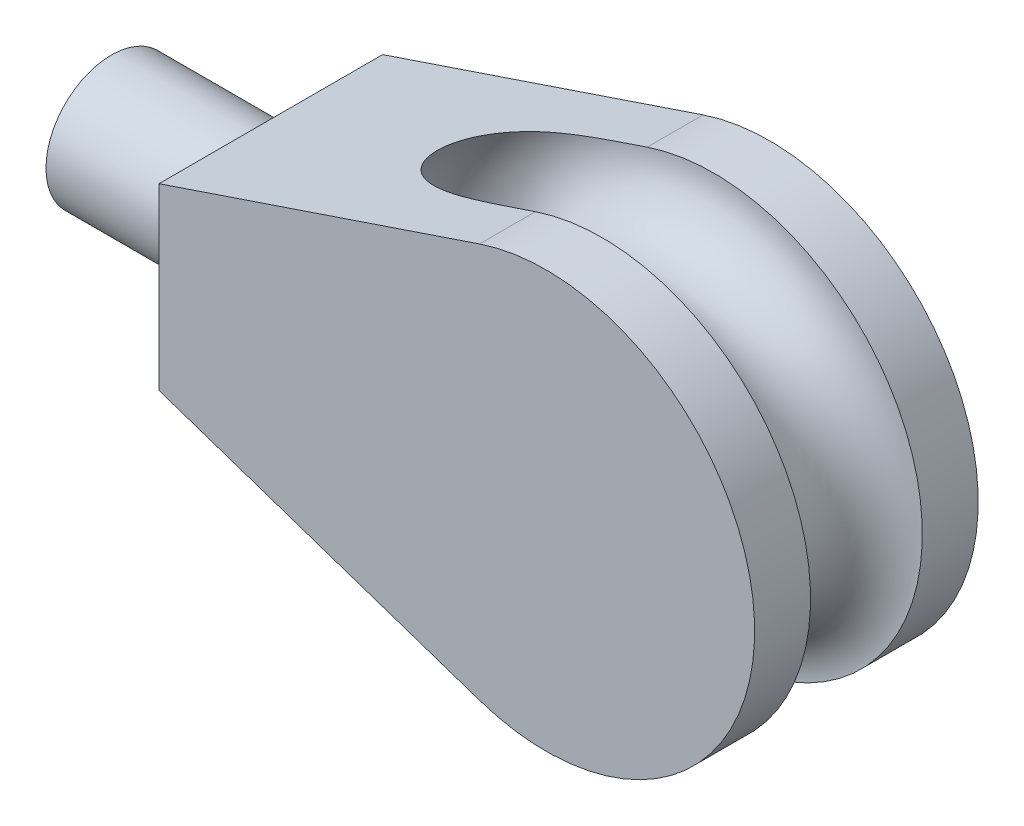
ISO-10303-21;
HEADER;
FILE_DESCRIPTION(('STEP AP214'),'2;1');
FILE_NAME('part.step','',(''),(''),'','','');
FILE_SCHEMA(('AUTOMOTIVE_DESIGN { 1 0 10303 214 1 1 1 1 }'));
ENDSEC;
DATA;
#1=APPLICATION_CONTEXT('core data for automotive mechanical design processes');
#2=APPLICATION_PROTOCOL_DEFINITION('international standard','automotive_design',2000,#1);
#3=PRODUCT_CONTEXT('',#1,'mechanical');
#4=PRODUCT('Part','Part','',(#3));
#5=PRODUCT_RELATED_PRODUCT_CATEGORY('part','',(#4));
#6=PRODUCT_DEFINITION_FORMATION('','',#4);
#7=PRODUCT_DEFINITION_CONTEXT('part definition',#1,'design');
#8=PRODUCT_DEFINITION('design','',#6,#7);
#9=PRODUCT_DEFINITION_SHAPE('','',#8);
#10=(LENGTH_UNIT() NAMED_UNIT(*) SI_UNIT(.MILLI.,.METRE.));
#11=(NAMED_UNIT(*) PLANE_ANGLE_UNIT() SI_UNIT($,.RADIAN.));
#12=(NAMED_UNIT(*) SI_UNIT($,.STERADIAN.) SOLID_ANGLE_UNIT());
#13=UNCERTAINTY_MEASURE_WITH_UNIT(LENGTH_MEASURE(1.E-05),#10,'distance_accuracy_value','');
#14=(GEOMETRIC_REPRESENTATION_CONTEXT(3) GLOBAL_UNCERTAINTY_ASSIGNED_CONTEXT((#13)) GLOBAL_UNIT_ASSIGNED_CONTEXT((#10,
#11,#12)) REPRESENTATION_CONTEXT('',''));
#15=CARTESIAN_POINT('',(0.,0.,0.));
#16=DIRECTION('',(0.,0.,1.));
#17=DIRECTION('',(1.,0.,0.));
#18=AXIS2_PLACEMENT_3D('',#15,#16,#17);
#19=CARTESIAN_POINT('',(-27.441594764438,6.35,7.9248));
#20=DIRECTION('',(0.319422438213122,-0.94761242391918,0.));
#21=DIRECTION('',(0.947612423919181,0.319422438213122,0.));
#22=AXIS2_PLACEMENT_3D('',#19,#20,#21);
#23=PLANE('',#22);
#24=CARTESIAN_POINT('',(-4.72175801961694,14.0084323565747,-3.9624));
#25=CARTESIAN_POINT('',(-4.87375292125447,13.9571977158592,-3.96238917819467));
#26=CARTESIAN_POINT('',(-5.02574780493794,13.9059630811957,-3.96239972989753));
#27=CARTESIAN_POINT('',(-5.32973779687316,13.8034937361709,-3.9623848262693));
#28=CARTESIAN_POINT('',(-5.4817329051249,13.7522590258096,-3.96235937088398));
#29=CARTESIAN_POINT('',(-5.78575466978362,13.6497789707936,-3.9621936814085));
#30=CARTESIAN_POINT('',(-5.93778132619623,13.5985336261369,-3.96205342351644));
#31=CARTESIAN_POINT('',(-6.24183410360383,13.4960431173028,-3.96149899201322));
#32=CARTESIAN_POINT('',(-6.39386022459869,13.4447979531254,-3.9610848183384));
#33=CARTESIAN_POINT('',(-6.85433481346953,13.2895805750079,-3.95911611340927));
#34=CARTESIAN_POINT('',(-7.16278204437302,13.1856087780281,-3.95682671973771));
#35=CARTESIAN_POINT('',(-7.77959982918194,12.9776910304515,-3.94787786773061));
#36=CARTESIAN_POINT('',(-8.08797038769579,12.8737450783013,-3.94121885404123));
#37=CARTESIAN_POINT('',(-8.71988771733575,12.6607375563569,-3.91969862529159));
#38=CARTESIAN_POINT('',(-9.04342393457329,12.5516795440813,-3.90444470085073));
#39=CARTESIAN_POINT('',(-9.68989459129765,12.3337663675633,-3.86068301344577));
#40=CARTESIAN_POINT('',(-10.0128287360294,12.2249113026774,-3.83216991636855));
#41=CARTESIAN_POINT('',(-10.6546572606567,12.0085629021327,-3.75631728653127));
#42=CARTESIAN_POINT('',(-10.9735642514009,11.9010653155926,-3.7091017542555));
#43=CARTESIAN_POINT('',(-11.6069235464141,11.6875717340697,-3.5890137292223));
#44=CARTESIAN_POINT('',(-11.9213807301883,11.581574094297,-3.51617204467111));
#45=CARTESIAN_POINT('',(-12.3571778504603,11.4346750296479,-3.38995389300559));
#46=CARTESIAN_POINT('',(-12.4822277110375,11.3925230586991,-3.35073480048685));
#47=CARTESIAN_POINT('',(-12.7304964966942,11.3088362909395,-3.26603879937078));
#48=CARTESIAN_POINT('',(-12.8537144778912,11.2673018122938,-3.2205587807247));
#49=CARTESIAN_POINT('',(-13.0974630737717,11.1851387160301,-3.12277136846088));
#50=CARTESIAN_POINT('',(-13.2179980125137,11.1445086408527,-3.07047605745588));
#51=CARTESIAN_POINT('',(-13.4558504863838,11.0643330171263,-2.958295743983));
#52=CARTESIAN_POINT('',(-13.5731684038016,11.0247873397145,-2.89841164811279));
#53=CARTESIAN_POINT('',(-13.8053521564008,10.9465225359861,-2.76936449751491));
#54=CARTESIAN_POINT('',(-13.9201583628721,10.9078235093931,-2.7000802541223));
#55=CARTESIAN_POINT('',(-14.1442443397287,10.8322883145284,-2.55220447949276));
#56=CARTESIAN_POINT('',(-14.253521856054,10.7954529060582,-2.47360919507086));
#57=CARTESIAN_POINT('',(-14.5701788592593,10.6887137482676,-2.22308390149108));
#58=CARTESIAN_POINT('',(-14.7674551575663,10.622215594997,-2.0358476275286));
#59=CARTESIAN_POINT('',(-15.04380177349,10.5290643153998,-1.70518791285539));
#60=CARTESIAN_POINT('',(-15.1379931516991,10.4973141621443,-1.57572698413031));
#61=CARTESIAN_POINT('',(-15.306154707292,10.4406300445184,-1.3026150863655));
#62=CARTESIAN_POINT('',(-15.3801339922191,10.4156930101653,-1.15897054829757));
#63=CARTESIAN_POINT('',(-15.4724952408247,10.384559759396,-0.934242571539767));
#64=CARTESIAN_POINT('',(-15.5002764283734,10.3751952402748,-0.857363837955497));
#65=CARTESIAN_POINT('',(-15.5488762809126,10.3588131382646,-0.7012083111911));
#66=CARTESIAN_POINT('',(-15.5696985528676,10.3517943395351,-0.621932783633136));
#67=CARTESIAN_POINT('',(-15.6039043201023,10.3402642146705,-0.461648100792318));
#68=CARTESIAN_POINT('',(-15.6172916760767,10.3357515871673,-0.380639867981749));
#69=CARTESIAN_POINT('',(-15.6363339408573,10.3293327955898,-0.217645525964102));
#70=CARTESIAN_POINT('',(-15.6419899056447,10.3274262755641,-0.135659551843766));
#71=CARTESIAN_POINT('',(-15.6466609182038,10.3258517645268,0.0898129764185861));
#72=CARTESIAN_POINT('',(-15.6375805859554,10.3289125748258,0.233578175398194));
#73=CARTESIAN_POINT('',(-15.5959498311145,10.3429455242471,0.517148136399786));
#74=CARTESIAN_POINT('',(-15.5633988020472,10.3539178678009,0.656952795985751));
#75=CARTESIAN_POINT('',(-15.4782731847583,10.3826121224798,0.925464285145831));
#76=CARTESIAN_POINT('',(-15.4262412624917,10.4001511110534,1.05436515897316));
#77=CARTESIAN_POINT('',(-15.3050396881039,10.4410058966482,1.30277617976003));
#78=CARTESIAN_POINT('',(-15.2358629045748,10.4643240975338,1.42228239169345));
#79=CARTESIAN_POINT('',(-15.0461523222668,10.5282719893364,1.70659234222675));
#80=CARTESIAN_POINT('',(-14.9170352748193,10.5717949329677,1.86501980001182));
#81=CARTESIAN_POINT('',(-14.6364695857077,10.6663683832865,2.15810602678022));
#82=CARTESIAN_POINT('',(-14.4849702444268,10.7174359798673,2.29270926718208));
#83=CARTESIAN_POINT('',(-14.203513362175,10.8123098347382,2.51100585959219));
#84=CARTESIAN_POINT('',(-14.0766731226746,10.8550653089616,2.59927466387219));
#85=CARTESIAN_POINT('',(-13.8161131013922,10.9428952225403,2.76378988250034));
#86=CARTESIAN_POINT('',(-13.6823893221164,10.9879710093759,2.8400292040527));
#87=CARTESIAN_POINT('',(-13.4097475174367,11.0798734663419,2.9816646847918));
#88=CARTESIAN_POINT('',(-13.2708238722312,11.1267020308023,3.04704867151826));
#89=CARTESIAN_POINT('',(-12.9892653298239,11.2216101534116,3.16801716458123));
#90=CARTESIAN_POINT('',(-12.8466312202841,11.2696894460544,3.22360373155704));
#91=CARTESIAN_POINT('',(-12.5264340373501,11.3776219322694,3.33753848647521));
#92=CARTESIAN_POINT('',(-12.3481853544484,11.4377062319931,3.39373019666638));
#93=CARTESIAN_POINT('',(-11.9888341513413,11.5588368066605,3.49496099924588));
#94=CARTESIAN_POINT('',(-11.8077304826174,11.6198834687483,3.53999547482943));
#95=CARTESIAN_POINT('',(-11.4433569063811,11.7427069915346,3.62059861667516));
#96=CARTESIAN_POINT('',(-11.2600839427954,11.8044848823784,3.6561516956989));
#97=CARTESIAN_POINT('',(-10.8923381654409,11.9284451111387,3.71917469293869));
#98=CARTESIAN_POINT('',(-10.7078655055087,11.9906273971998,3.74664562742104));
#99=CARTESIAN_POINT('',(-10.3366547925256,12.1157555910045,3.79503510718763));
#100=CARTESIAN_POINT('',(-10.149910462866,12.1787036144756,3.81589907090181));
#101=CARTESIAN_POINT('',(-9.77592631071417,12.3047666827913,3.85199582633532));
#102=CARTESIAN_POINT('',(-9.58868644206782,12.3678817431937,3.8672280734958));
#103=CARTESIAN_POINT('',(-9.2140905939859,12.4941510027756,3.89314575412079));
#104=CARTESIAN_POINT('',(-9.02673484601473,12.5573051239327,3.90383501517843));
#105=CARTESIAN_POINT('',(-8.65186914415107,12.6836653461811,3.92166151611251));
#106=CARTESIAN_POINT('',(-8.46435918412974,12.7468714493383,3.92879860722922));
#107=CARTESIAN_POINT('',(-7.97802606381771,12.9108052551356,3.94383798648918));
#108=CARTESIAN_POINT('',(-7.67914827409666,13.0115513723357,3.94968314824669));
#109=CARTESIAN_POINT('',(-7.08132592750043,13.2130661126958,3.95753301352023));
#110=CARTESIAN_POINT('',(-6.78238136690435,13.31383473711,3.95953726821307));
#111=CARTESIAN_POINT('',(-6.3366141547673,13.4640945333961,3.96125550703739));
#112=CARTESIAN_POINT('',(-6.18979302747341,13.5135851914728,3.96161594287448));
#113=CARTESIAN_POINT('',(-5.89615052829348,13.6125665900736,3.96209843227997));
#114=CARTESIAN_POINT('',(-5.74932915640773,13.6620573305977,3.96222048602849));
#115=CARTESIAN_POINT('',(-5.45571611101741,13.7610288008765,3.9623646619029));
#116=CARTESIAN_POINT('',(-5.3089244375132,13.8105095306311,3.96238680423868));
#117=CARTESIAN_POINT('',(-5.01534118340458,13.9094709588257,3.96239976093781));
#118=CARTESIAN_POINT('',(-4.86854960280018,13.9589516572655,3.96239057532172));
#119=CARTESIAN_POINT('',(-4.72175801961694,14.0084323565747,3.9624));
#120=B_SPLINE_CURVE_WITH_KNOTS('',3,(#24,#25,#26,#27,#28,#29,#30,#31,#32,#33,#34,#35,#36,#37,
#38,#39,#40,#41,#42,#43,#44,#45,#46,#47,#48,#49,#50,#51,#52,#53,#54,#55,#56,#57,#58,#59,#60,#61,
#62,#63,#64,#65,#66,#67,#68,#69,#70,#71,#72,#73,#74,#75,#76,#77,#78,#79,#80,#81,#82,#83,#84,#85,
#86,#87,#88,#89,#90,#91,#92,#93,#94,#95,#96,#97,#98,#99,#100,#101,#102,#103,#104,#105,#106,#107,
#108,#109,#110,#111,#112,#113,#114,#115,#116,#117,#118,#119),.UNSPECIFIED.,.F.,.F.,(4,2,2,2,2,2,
2,2,2,2,2,2,2,2,2,2,2,2,2,2,2,2,2,2,2,2,2,2,2,2,2,2,2,2,2,2,2,2,2,2,2,2,2,2,2,2,2,4),(0.,
0.481193212926235,0.96238715066043,1.44368087919563,1.92497471958098,2.90148405432016,
3.87789403630306,4.90302694671164,5.92857262132071,6.94742960029572,7.96506585404123,
8.37794487966876,8.79102974364672,9.20339197967427,9.61570499901703,10.033954737665,
10.4523736458242,11.2854558228466,11.7735710049318,12.2614658788314,12.5080002162783,
12.7544065704565,13.0006848544195,13.2469294974466,13.6767684613279,14.1066185325009,
14.5252915334791,14.9441389746924,15.5675118125364,16.1923189808555,16.6726758225986,
17.1533148413126,17.6344892292539,18.1155622932607,18.7040903835952,19.2928615985178,
19.882594857395,20.4722539302149,21.066664365639,21.6611322625587,22.2550983059142,
22.8490892216124,23.795404476015,24.7418303038642,25.2066452996287,25.671459944159,
26.1361805626305,26.6009008761329),.UNSPECIFIED.);
#121=CARTESIAN_POINT('',(-4.72195801961694,14.0083649403125,-3.9624));
#122=VERTEX_POINT('',#121);
#123=CARTESIAN_POINT('',(-4.72195801961694,14.0083649403125,3.9624));
#124=VERTEX_POINT('',#123);
#125=EDGE_CURVE('E96',#122,#124,#120,.T.);
#126=ORIENTED_EDGE('',*,*,#125,.F.);
#127=DIRECTION('',(0.,0.,-1.));
#128=VECTOR('',#127,1.);
#129=CARTESIAN_POINT('',(-4.72195801961694,14.0083649403125,7.9248));
#130=LINE('',#129,#128);
#131=CARTESIAN_POINT('',(-4.72195801961694,14.0083649403125,-7.9248));
#132=VERTEX_POINT('',#131);
#133=EDGE_CURVE('E80',#122,#132,#130,.T.);
#134=ORIENTED_EDGE('',*,*,#133,.T.);
#135=DIRECTION('',(-0.94761242391918,-0.319422438213122,0.));
#136=VECTOR('',#135,1.);
#137=CARTESIAN_POINT('',(-27.441594764438,6.35,-7.9248));
#138=LINE('',#137,#136);
#139=CARTESIAN_POINT('',(-27.441594764438,6.35,-7.9248));
#140=VERTEX_POINT('',#139);
#141=EDGE_CURVE('E135',#132,#140,#138,.T.);
#142=ORIENTED_EDGE('',*,*,#141,.T.);
#143=DIRECTION('',(0.,0.,-1.));
#144=VECTOR('',#143,1.);
#145=CARTESIAN_POINT('',(-27.441594764438,6.35,7.9248));
#146=LINE('',#145,#144);
#147=CARTESIAN_POINT('',(-27.441594764438,6.35,7.9248));
#148=VERTEX_POINT('',#147);
#149=EDGE_CURVE('E123',#148,#140,#146,.T.);
#150=ORIENTED_EDGE('',*,*,#149,.F.);
#151=DIRECTION('',(-0.94761242391918,-0.319422438213122,0.));
#152=VECTOR('',#151,1.);
#153=CARTESIAN_POINT('',(-27.441594764438,6.35,7.9248));
#154=LINE('',#153,#152);
#155=CARTESIAN_POINT('',(-4.72195801961694,14.0083649403125,7.9248));
#156=VERTEX_POINT('',#155);
#157=EDGE_CURVE('E131',#156,#148,#154,.T.);
#158=ORIENTED_EDGE('',*,*,#157,.F.);
#159=EDGE_CURVE('E103',#156,#124,#130,.T.);
#160=ORIENTED_EDGE('',*,*,#159,.T.);
#161=EDGE_LOOP('',(#126,#134,#142,#150,#158,#160));
#162=FACE_BOUND('',#161,.T.);
#163=ADVANCED_FACE('F35',(#162),#23,.F.);
#164=CARTESIAN_POINT('',(-27.441594764438,-6.35,7.9248));
#165=DIRECTION('',(0.319422438213122,0.94761242391918,0.));
#166=DIRECTION('',(-0.947612423919181,0.319422438213122,0.));
#167=AXIS2_PLACEMENT_3D('',#164,#165,#166);
#168=PLANE('',#167);
#169=CARTESIAN_POINT('',(-4.72175801961694,-14.0084323565747,3.9624));
#170=CARTESIAN_POINT('',(-4.87375292125446,-13.9571977158592,3.96238917819467));
#171=CARTESIAN_POINT('',(-5.02574780493793,-13.9059630811957,3.96239972989753));
#172=CARTESIAN_POINT('',(-5.32973779687315,-13.8034937361709,3.9623848262693));
#173=CARTESIAN_POINT('',(-5.4817329051249,-13.7522590258096,3.96235937088398));
#174=CARTESIAN_POINT('',(-5.78575466978362,-13.6497789707936,3.9621936814085));
#175=CARTESIAN_POINT('',(-5.93778132619623,-13.5985336261369,3.96205342351644));
#176=CARTESIAN_POINT('',(-6.24183410360383,-13.4960431173028,3.96149899201322));
#177=CARTESIAN_POINT('',(-6.39386022459869,-13.4447979531254,3.9610848183384));
#178=CARTESIAN_POINT('',(-6.85433481346953,-13.2895805750079,3.95911611340927));
#179=CARTESIAN_POINT('',(-7.16278204437301,-13.1856087780281,3.95682671973771));
#180=CARTESIAN_POINT('',(-7.77959982918193,-12.9776910304515,3.94787786773061));
#181=CARTESIAN_POINT('',(-8.08797038769578,-12.8737450783013,3.94121885404123));
#182=CARTESIAN_POINT('',(-8.71988771733574,-12.6607375563569,3.91969862529159));
#183=CARTESIAN_POINT('',(-9.04342393457328,-12.5516795440813,3.90444470085073));
#184=CARTESIAN_POINT('',(-9.68989459129764,-12.3337663675633,3.86068301344577));
#185=CARTESIAN_POINT('',(-10.0128287360294,-12.2249113026774,3.83216991636855));
#186=CARTESIAN_POINT('',(-10.6546572606567,-12.0085629021327,3.75631728653128));
#187=CARTESIAN_POINT('',(-10.9735642514009,-11.9010653155926,3.7091017542555));
#188=CARTESIAN_POINT('',(-11.6069235464141,-11.6875717340697,3.5890137292223));
#189=CARTESIAN_POINT('',(-11.9213807301883,-11.581574094297,3.51617204467111));
#190=CARTESIAN_POINT('',(-12.3571778504603,-11.4346750296479,3.38995389300559));
#191=CARTESIAN_POINT('',(-12.4822277110375,-11.3925230586991,3.35073480048686));
#192=CARTESIAN_POINT('',(-12.7304964966942,-11.3088362909395,3.26603879937078));
#193=CARTESIAN_POINT('',(-12.8537144778912,-11.2673018122938,3.2205587807247));
#194=CARTESIAN_POINT('',(-13.0974630737717,-11.1851387160301,3.12277136846088));
#195=CARTESIAN_POINT('',(-13.2179980125137,-11.1445086408527,3.07047605745588));
#196=CARTESIAN_POINT('',(-13.4558504863838,-11.0643330171263,2.95829574398301));
#197=CARTESIAN_POINT('',(-13.5731684038016,-11.0247873397145,2.8984116481128));
#198=CARTESIAN_POINT('',(-13.8053521564008,-10.9465225359861,2.76936449751491));
#199=CARTESIAN_POINT('',(-13.9201583628721,-10.9078235093931,2.7000802541223));
#200=CARTESIAN_POINT('',(-14.1442443397287,-10.8322883145284,2.55220447949276));
#201=CARTESIAN_POINT('',(-14.253521856054,-10.7954529060582,2.47360919507086));
#202=CARTESIAN_POINT('',(-14.5701788592593,-10.6887137482676,2.22308390149108));
#203=CARTESIAN_POINT('',(-14.7674551575663,-10.622215594997,2.0358476275286));
#204=CARTESIAN_POINT('',(-15.04380177349,-10.5290643153998,1.70518791285539));
#205=CARTESIAN_POINT('',(-15.1379931516991,-10.4973141621443,1.57572698413031));
#206=CARTESIAN_POINT('',(-15.306154707292,-10.4406300445184,1.30261508636551));
#207=CARTESIAN_POINT('',(-15.3801339922191,-10.4156930101654,1.15897054829758));
#208=CARTESIAN_POINT('',(-15.4724952408247,-10.384559759396,0.934242571539767));
#209=CARTESIAN_POINT('',(-15.5002764283734,-10.3751952402748,0.857363837955497));
#210=CARTESIAN_POINT('',(-15.5488762809126,-10.3588131382646,0.701208311191101));
#211=CARTESIAN_POINT('',(-15.5696985528676,-10.3517943395351,0.621932783633136));
#212=CARTESIAN_POINT('',(-15.6039043201023,-10.3402642146705,0.461648100792319));
#213=CARTESIAN_POINT('',(-15.6172916760767,-10.3357515871673,0.38063986798175));
#214=CARTESIAN_POINT('',(-15.6363339408573,-10.3293327955898,0.217645525964103));
#215=CARTESIAN_POINT('',(-15.6419899056447,-10.3274262755641,0.135659551843767));
#216=CARTESIAN_POINT('',(-15.6466609182038,-10.3258517645268,-0.0898129764185863));
#217=CARTESIAN_POINT('',(-15.6375805859554,-10.3289125748258,-0.233578175398195));
#218=CARTESIAN_POINT('',(-15.5959498311145,-10.3429455242471,-0.517148136399786));
#219=CARTESIAN_POINT('',(-15.5633988020472,-10.3539178678009,-0.656952795985752));
#220=CARTESIAN_POINT('',(-15.4782731847583,-10.3826121224798,-0.925464285145831));
#221=CARTESIAN_POINT('',(-15.4262412624917,-10.4001511110534,-1.05436515897316));
#222=CARTESIAN_POINT('',(-15.3050396881039,-10.4410058966482,-1.30277617976003));
#223=CARTESIAN_POINT('',(-15.2358629045748,-10.4643240975338,-1.42228239169345));
#224=CARTESIAN_POINT('',(-15.0461523222668,-10.5282719893364,-1.70659234222675));
#225=CARTESIAN_POINT('',(-14.9170352748193,-10.5717949329677,-1.86501980001181));
#226=CARTESIAN_POINT('',(-14.6364695857077,-10.6663683832865,-2.15810602678022));
#227=CARTESIAN_POINT('',(-14.4849702444268,-10.7174359798673,-2.29270926718208));
#228=CARTESIAN_POINT('',(-14.203513362175,-10.8123098347382,-2.51100585959219));
#229=CARTESIAN_POINT('',(-14.0766731226746,-10.8550653089616,-2.59927466387219));
#230=CARTESIAN_POINT('',(-13.8161131013922,-10.9428952225403,-2.76378988250034));
#231=CARTESIAN_POINT('',(-13.6823893221165,-10.9879710093759,-2.8400292040527));
#232=CARTESIAN_POINT('',(-13.4097475174367,-11.0798734663419,-2.9816646847918));
#233=CARTESIAN_POINT('',(-13.2708238722312,-11.1267020308023,-3.04704867151826));
#234=CARTESIAN_POINT('',(-12.9892653298239,-11.2216101534116,-3.16801716458123));
#235=CARTESIAN_POINT('',(-12.8466312202841,-11.2696894460544,-3.22360373155704));
#236=CARTESIAN_POINT('',(-12.5264340373501,-11.3776219322693,-3.3375384864752));
#237=CARTESIAN_POINT('',(-12.3481853544484,-11.4377062319931,-3.39373019666638));
#238=CARTESIAN_POINT('',(-11.9888341513413,-11.5588368066605,-3.49496099924588));
#239=CARTESIAN_POINT('',(-11.8077304826174,-11.6198834687483,-3.53999547482943));
#240=CARTESIAN_POINT('',(-11.4433569063811,-11.7427069915346,-3.62059861667516));
#241=CARTESIAN_POINT('',(-11.2600839427954,-11.8044848823784,-3.6561516956989));
#242=CARTESIAN_POINT('',(-10.8923381654409,-11.9284451111387,-3.71917469293869));
#243=CARTESIAN_POINT('',(-10.7078655055087,-11.9906273971998,-3.74664562742104));
#244=CARTESIAN_POINT('',(-10.3366547925256,-12.1157555910045,-3.79503510718763));
#245=CARTESIAN_POINT('',(-10.149910462866,-12.1787036144755,-3.81589907090181));
#246=CARTESIAN_POINT('',(-9.77592631071419,-12.3047666827913,-3.85199582633532));
#247=CARTESIAN_POINT('',(-9.58868644206783,-12.3678817431937,-3.8672280734958));
#248=CARTESIAN_POINT('',(-9.21409059398592,-12.4941510027756,-3.89314575412079));
#249=CARTESIAN_POINT('',(-9.02673484601475,-12.5573051239327,-3.90383501517843));
#250=CARTESIAN_POINT('',(-8.65186914415109,-12.6836653461811,-3.92166151611251));
#251=CARTESIAN_POINT('',(-8.46435918412976,-12.7468714493383,-3.92879860722922));
#252=CARTESIAN_POINT('',(-7.97802606381773,-12.9108052551356,-3.94383798648918));
#253=CARTESIAN_POINT('',(-7.67914827409668,-13.0115513723357,-3.94968314824669));
#254=CARTESIAN_POINT('',(-7.08132592750044,-13.2130661126958,-3.95753301352023));
#255=CARTESIAN_POINT('',(-6.78238136690436,-13.31383473711,-3.95953726821307));
#256=CARTESIAN_POINT('',(-6.33661415476731,-13.4640945333961,-3.96125550703739));
#257=CARTESIAN_POINT('',(-6.18979302747341,-13.5135851914728,-3.96161594287448));
#258=CARTESIAN_POINT('',(-5.89615052829349,-13.6125665900736,-3.96209843227997));
#259=CARTESIAN_POINT('',(-5.74932915640773,-13.6620573305977,-3.96222048602849));
#260=CARTESIAN_POINT('',(-5.45571611101741,-13.7610288008765,-3.9623646619029));
#261=CARTESIAN_POINT('',(-5.3089244375132,-13.8105095306311,-3.96238680423868));
#262=CARTESIAN_POINT('',(-5.01534118340458,-13.9094709588257,-3.96239976093781));
#263=CARTESIAN_POINT('',(-4.86854960280018,-13.9589516572655,-3.96239057532172));
#264=CARTESIAN_POINT('',(-4.72175801961694,-14.0084323565747,-3.9624));
#265=B_SPLINE_CURVE_WITH_KNOTS('',3,(#169,#170,#171,#172,#173,#174,#175,#176,#177,#178,#179,
#180,#181,#182,#183,#184,#185,#186,#187,#188,#189,#190,#191,#192,#193,#194,#195,#196,#197,#198,
#199,#200,#201,#202,#203,#204,#205,#206,#207,#208,#209,#210,#211,#212,#213,#214,#215,#216,#217,
#218,#219,#220,#221,#222,#223,#224,#225,#226,#227,#228,#229,#230,#231,#232,#233,#234,#235,#236,
#237,#238,#239,#240,#241,#242,#243,#244,#245,#246,#247,#248,#249,#250,#251,#252,#253,#254,#255,
#256,#257,#258,#259,#260,#261,#262,#263,#264),.UNSPECIFIED.,.F.,.F.,(4,2,2,2,2,2,2,2,2,2,2,2,2,
2,2,2,2,2,2,2,2,2,2,2,2,2,2,2,2,2,2,2,2,2,2,2,2,2,2,2,2,2,2,2,2,2,2,4),(0.,0.481193212926235,
0.96238715066043,1.44368087919563,1.92497471958098,2.90148405432016,3.87789403630306,
4.90302694671164,5.92857262132071,6.94742960029572,7.96506585404123,8.37794487966876,
8.79102974364672,9.20339197967426,9.61570499901702,10.033954737665,10.4523736458242,
11.2854558228466,11.7735710049318,12.2614658788314,12.5080002162783,12.7544065704565,
13.0006848544195,13.2469294974466,13.6767684613279,14.1066185325009,14.5252915334791,
14.9441389746924,15.5675118125364,16.1923189808555,16.6726758225986,17.1533148413126,
17.6344892292539,18.1155622932607,18.7040903835951,19.2928615985178,19.882594857395,
20.4722539302149,21.066664365639,21.6611322625587,22.2550983059141,22.8490892216124,
23.795404476015,24.7418303038642,25.2066452996287,25.671459944159,26.1361805626305,
26.6009008761329),.UNSPECIFIED.);
#266=CARTESIAN_POINT('',(-4.72195801961694,-14.0083649403125,3.9624));
#267=VERTEX_POINT('',#266);
#268=CARTESIAN_POINT('',(-4.72195801961693,-14.0083649403125,-3.9624));
#269=VERTEX_POINT('',#268);
#270=EDGE_CURVE('E49',#267,#269,#265,.T.);
#271=ORIENTED_EDGE('',*,*,#270,.F.);
#272=DIRECTION('',(0.,0.,-1.));
#273=VECTOR('',#272,1.);
#274=CARTESIAN_POINT('',(-4.72195801961693,-14.0083649403125,7.9248));
#275=LINE('',#274,#273);
#276=CARTESIAN_POINT('',(-4.72195801961693,-14.0083649403125,7.9248));
#277=VERTEX_POINT('',#276);
#278=EDGE_CURVE('E117',#277,#267,#275,.T.);
#279=ORIENTED_EDGE('',*,*,#278,.F.);
#280=DIRECTION('',(0.94761242391918,-0.319422438213122,0.));
#281=VECTOR('',#280,1.);
#282=CARTESIAN_POINT('',(-27.441594764438,-6.35,7.9248));
#283=LINE('',#282,#281);
#284=CARTESIAN_POINT('',(-27.441594764438,-6.35,7.9248));
#285=VERTEX_POINT('',#284);
#286=EDGE_CURVE('E112',#285,#277,#283,.T.);
#287=ORIENTED_EDGE('',*,*,#286,.F.);
#288=DIRECTION('',(0.,0.,-1.));
#289=VECTOR('',#288,1.);
#290=CARTESIAN_POINT('',(-27.441594764438,-6.35,7.9248));
#291=LINE('',#290,#289);
#292=CARTESIAN_POINT('',(-27.441594764438,-6.35,-7.9248));
#293=VERTEX_POINT('',#292);
#294=EDGE_CURVE('E120',#285,#293,#291,.T.);
#295=ORIENTED_EDGE('',*,*,#294,.T.);
#296=DIRECTION('',(0.94761242391918,-0.319422438213122,0.));
#297=VECTOR('',#296,1.);
#298=CARTESIAN_POINT('',(-27.441594764438,-6.35,-7.9248));
#299=LINE('',#298,#297);
#300=CARTESIAN_POINT('',(-4.72195801961693,-14.0083649403125,-7.9248));
#301=VERTEX_POINT('',#300);
#302=EDGE_CURVE('E138',#293,#301,#299,.T.);
#303=ORIENTED_EDGE('',*,*,#302,.T.);
#304=EDGE_CURVE('E111',#269,#301,#275,.T.);
#305=ORIENTED_EDGE('',*,*,#304,.F.);
#306=EDGE_LOOP('',(#271,#279,#287,#295,#303,#305));
#307=FACE_BOUND('',#306,.T.);
#308=ADVANCED_FACE('F142',(#307),#168,.F.);
#309=CARTESIAN_POINT('',(0.,0.,7.9248));
#310=DIRECTION('',(0.,0.,-1.));
#311=DIRECTION('',(-1.,0.,0.));
#312=AXIS2_PLACEMENT_3D('',#309,#310,#311);
#313=CYLINDRICAL_SURFACE('',#312,14.7828);
#314=CARTESIAN_POINT('',(0.,0.,3.9624));
#315=DIRECTION('',(0.,0.,-1.));
#316=DIRECTION('',(-1.,0.,0.));
#317=AXIS2_PLACEMENT_3D('',#314,#315,#316);
#318=CIRCLE('',#317,14.7828);
#319=EDGE_CURVE('E11',#124,#267,#318,.T.);
#320=ORIENTED_EDGE('',*,*,#319,.F.);
#321=ORIENTED_EDGE('',*,*,#159,.F.);
#322=CARTESIAN_POINT('',(0.,0.,7.9248));
#323=DIRECTION('',(0.,0.,1.));
#324=DIRECTION('',(1.,0.,0.));
#325=AXIS2_PLACEMENT_3D('',#322,#323,#324);
#326=CIRCLE('',#325,14.7828);
#327=EDGE_CURVE('E58',#277,#156,#326,.T.);
#328=ORIENTED_EDGE('',*,*,#327,.F.);
#329=ORIENTED_EDGE('',*,*,#278,.T.);
#330=EDGE_LOOP('',(#320,#321,#328,#329));
#331=FACE_BOUND('',#330,.T.);
#332=ADVANCED_FACE('F150',(#331),#313,.T.);
#333=CARTESIAN_POINT('',(0.,0.,-3.9624));
#334=DIRECTION('',(0.,0.,1.));
#335=DIRECTION('',(1.,0.,0.));
#336=AXIS2_PLACEMENT_3D('',#333,#334,#335);
#337=CIRCLE('',#336,14.7828);
#338=EDGE_CURVE('E43',#269,#122,#337,.T.);
#339=ORIENTED_EDGE('',*,*,#338,.F.);
#340=ORIENTED_EDGE('',*,*,#304,.T.);
#341=CARTESIAN_POINT('',(0.,0.,-7.9248));
#342=DIRECTION('',(0.,0.,1.));
#343=DIRECTION('',(1.,0.,0.));
#344=AXIS2_PLACEMENT_3D('',#341,#342,#343);
#345=CIRCLE('',#344,14.7828);
#346=EDGE_CURVE('E108',#301,#132,#345,.T.);
#347=ORIENTED_EDGE('',*,*,#346,.T.);
#348=ORIENTED_EDGE('',*,*,#133,.F.);
#349=EDGE_LOOP('',(#339,#340,#347,#348));
#350=FACE_BOUND('',#349,.T.);
#351=ADVANCED_FACE('F106',(#350),#313,.T.);
#352=CARTESIAN_POINT('',(-27.441594764438,6.35,7.9248));
#353=DIRECTION('',(1.,0.,0.));
#354=DIRECTION('',(0.,0.,-1.));
#355=AXIS2_PLACEMENT_3D('',#352,#353,#354);
#356=PLANE('',#355);
#357=CARTESIAN_POINT('',(-27.441594764438,0.,0.));
#358=DIRECTION('',(-1.,0.,0.));
#359=DIRECTION('',(0.,0.,1.));
#360=AXIS2_PLACEMENT_3D('',#357,#358,#359);
#361=CIRCLE('',#360,4.6355);
#362=CARTESIAN_POINT('',(-27.441594764438,0.,4.6355));
#363=VERTEX_POINT('',#362);
#364=EDGE_CURVE('E100',#363,#363,#361,.T.);
#365=ORIENTED_EDGE('',*,*,#364,.F.);
#366=EDGE_LOOP('',(#365));
#367=FACE_BOUND('',#366,.T.);
#368=DIRECTION('',(0.,-1.,0.));
#369=VECTOR('',#368,1.);
#370=CARTESIAN_POINT('',(-27.441594764438,6.35,-7.9248));
#371=LINE('',#370,#369);
#372=EDGE_CURVE('E137',#140,#293,#371,.T.);
#373=ORIENTED_EDGE('',*,*,#372,.T.);
#374=ORIENTED_EDGE('',*,*,#294,.F.);
#375=DIRECTION('',(0.,-1.,0.));
#376=VECTOR('',#375,1.);
#377=CARTESIAN_POINT('',(-27.441594764438,6.35,7.9248));
#378=LINE('',#377,#376);
#379=EDGE_CURVE('E88',#148,#285,#378,.T.);
#380=ORIENTED_EDGE('',*,*,#379,.F.);
#381=ORIENTED_EDGE('',*,*,#149,.T.);
#382=EDGE_LOOP('',(#373,#374,#380,#381));
#383=FACE_BOUND('',#382,.T.);
#384=ADVANCED_FACE('F148',(#367,#383),#356,.F.);
#385=CARTESIAN_POINT('',(0.,0.,7.9248));
#386=DIRECTION('',(0.,0.,1.));
#387=DIRECTION('',(1.,0.,0.));
#388=AXIS2_PLACEMENT_3D('',#385,#386,#387);
#389=PLANE('',#388);
#390=ORIENTED_EDGE('',*,*,#157,.T.);
#391=ORIENTED_EDGE('',*,*,#379,.T.);
#392=ORIENTED_EDGE('',*,*,#286,.T.);
#393=ORIENTED_EDGE('',*,*,#327,.T.);
#394=EDGE_LOOP('',(#390,#391,#392,#393));
#395=FACE_BOUND('',#394,.T.);
#396=ADVANCED_FACE('F146',(#395),#389,.T.);
#397=CARTESIAN_POINT('',(0.,0.,-7.9248));
#398=DIRECTION('',(0.,0.,1.));
#399=DIRECTION('',(1.,0.,0.));
#400=AXIS2_PLACEMENT_3D('',#397,#398,#399);
#401=PLANE('',#400);
#402=ORIENTED_EDGE('',*,*,#141,.F.);
#403=ORIENTED_EDGE('',*,*,#346,.F.);
#404=ORIENTED_EDGE('',*,*,#302,.F.);
#405=ORIENTED_EDGE('',*,*,#372,.F.);
#406=EDGE_LOOP('',(#402,#403,#404,#405));
#407=FACE_BOUND('',#406,.T.);
#408=ADVANCED_FACE('F145',(#407),#401,.F.);
#409=CARTESIAN_POINT('',(-38.744594764438,0.,0.));
#410=DIRECTION('',(1.,0.,0.));
#411=DIRECTION('',(0.,0.,-1.));
#412=AXIS2_PLACEMENT_3D('',#409,#410,#411);
#413=CYLINDRICAL_SURFACE('',#412,4.6355);
#414=CARTESIAN_POINT('',(-38.744594764438,0.,0.));
#415=DIRECTION('',(-1.,0.,0.));
#416=DIRECTION('',(0.,0.,1.));
#417=AXIS2_PLACEMENT_3D('',#414,#415,#416);
#418=CIRCLE('',#417,4.6355);
#419=CARTESIAN_POINT('',(-38.744594764438,0.,4.6355));
#420=VERTEX_POINT('',#419);
#421=EDGE_CURVE('E104',#420,#420,#418,.T.);
#422=ORIENTED_EDGE('',*,*,#421,.F.);
#423=EDGE_LOOP('',(#422));
#424=FACE_BOUND('',#423,.T.);
#425=ORIENTED_EDGE('',*,*,#364,.T.);
#426=EDGE_LOOP('',(#425));
#427=FACE_BOUND('',#426,.T.);
#428=ADVANCED_FACE('F195',(#424,#427),#413,.T.);
#429=CARTESIAN_POINT('',(-38.744594764438,0.,0.));
#430=DIRECTION('',(-1.,0.,0.));
#431=DIRECTION('',(0.,0.,1.));
#432=AXIS2_PLACEMENT_3D('',#429,#430,#431);
#433=PLANE('',#432);
#434=ORIENTED_EDGE('',*,*,#421,.T.);
#435=EDGE_LOOP('',(#434));
#436=FACE_BOUND('',#435,.T.);
#437=ADVANCED_FACE('F187',(#436),#433,.T.);
#438=CARTESIAN_POINT('',(0.,0.,0.));
#439=DIRECTION('',(0.,0.,1.));
#440=DIRECTION('',(1.,0.,0.));
#441=AXIS2_PLACEMENT_3D('',#438,#439,#440);
#442=TOROIDAL_SURFACE('',#441,14.7828,3.9624);
#443=ORIENTED_EDGE('',*,*,#319,.T.);
#444=ORIENTED_EDGE('',*,*,#270,.T.);
#445=ORIENTED_EDGE('',*,*,#338,.T.);
#446=ORIENTED_EDGE('',*,*,#125,.T.);
#447=EDGE_LOOP('',(#443,#444,#445,#446));
#448=FACE_BOUND('',#447,.T.);
#449=ADVANCED_FACE('F95',(#448),#442,.F.);
#450=CLOSED_SHELL('',(#163,#308,#332,#351,#384,#396,#408,#428,#437,#449));
#451=MANIFOLD_SOLID_BREP('B2',#450);
#452=ADVANCED_BREP_SHAPE_REPRESENTATION('',(#18,#451),#14);
#453=SHAPE_DEFINITION_REPRESENTATION(#9,#452);
ENDSEC;
END-ISO-10303-21;
